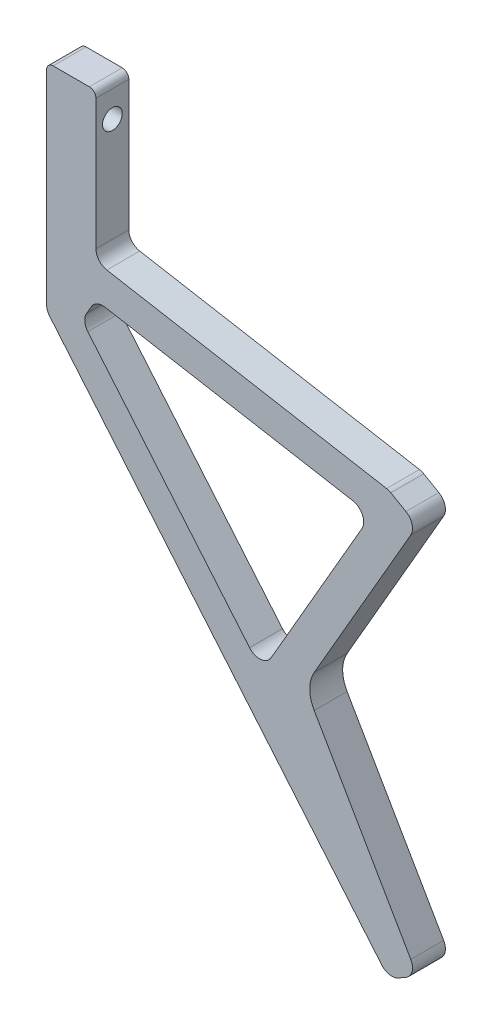
ISO-10303-21;
HEADER;
FILE_DESCRIPTION(('STEP AP214'),'2;1');
FILE_NAME('part.step','',(''),(''),'','','');
FILE_SCHEMA(('AUTOMOTIVE_DESIGN { 1 0 10303 214 1 1 1 1 }'));
ENDSEC;
DATA;
#1=APPLICATION_CONTEXT('core data for automotive mechanical design processes');
#2=APPLICATION_PROTOCOL_DEFINITION('international standard','automotive_design',2000,#1);
#3=PRODUCT_CONTEXT('',#1,'mechanical');
#4=PRODUCT('Part','Part','',(#3));
#5=PRODUCT_RELATED_PRODUCT_CATEGORY('part','',(#4));
#6=PRODUCT_DEFINITION_FORMATION('','',#4);
#7=PRODUCT_DEFINITION_CONTEXT('part definition',#1,'design');
#8=PRODUCT_DEFINITION('design','',#6,#7);
#9=PRODUCT_DEFINITION_SHAPE('','',#8);
#10=(LENGTH_UNIT() NAMED_UNIT(*) SI_UNIT(.MILLI.,.METRE.));
#11=(NAMED_UNIT(*) PLANE_ANGLE_UNIT() SI_UNIT($,.RADIAN.));
#12=(NAMED_UNIT(*) SI_UNIT($,.STERADIAN.) SOLID_ANGLE_UNIT());
#13=UNCERTAINTY_MEASURE_WITH_UNIT(LENGTH_MEASURE(1.E-05),#10,'distance_accuracy_value','');
#14=(GEOMETRIC_REPRESENTATION_CONTEXT(3) GLOBAL_UNCERTAINTY_ASSIGNED_CONTEXT((#13)) GLOBAL_UNIT_ASSIGNED_CONTEXT((#10,
#11,#12)) REPRESENTATION_CONTEXT('',''));
#15=CARTESIAN_POINT('',(0.,0.,0.));
#16=DIRECTION('',(0.,0.,1.));
#17=DIRECTION('',(1.,0.,0.));
#18=AXIS2_PLACEMENT_3D('',#15,#16,#17);
#19=CARTESIAN_POINT('',(-57.15,79.375,3.175));
#20=DIRECTION('',(1.,0.,0.));
#21=DIRECTION('',(0.,1.,0.));
#22=AXIS2_PLACEMENT_3D('',#19,#20,#21);
#23=PLANE('',#22);
#24=CARTESIAN_POINT('',(-57.15,73.025,0.));
#25=DIRECTION('',(1.,0.,0.));
#26=DIRECTION('',(0.,1.,0.));
#27=AXIS2_PLACEMENT_3D('',#24,#25,#26);
#28=CIRCLE('',#27,1.90500000000001);
#29=CARTESIAN_POINT('',(-57.15,74.93,0.));
#30=VERTEX_POINT('',#29);
#31=EDGE_CURVE('E269',#30,#30,#28,.F.);
#32=ORIENTED_EDGE('',*,*,#31,.F.);
#33=EDGE_LOOP('',(#32));
#34=FACE_BOUND('',#33,.T.);
#35=DIRECTION('',(0.,-1.,0.));
#36=VECTOR('',#35,1.);
#37=CARTESIAN_POINT('',(-57.15,79.375,3.175));
#38=LINE('',#37,#36);
#39=CARTESIAN_POINT('',(-57.15,78.105,3.175));
#40=VERTEX_POINT('',#39);
#41=CARTESIAN_POINT('',(-57.15,38.8194990204618,3.175));
#42=VERTEX_POINT('',#41);
#43=EDGE_CURVE('E301',#40,#42,#38,.T.);
#44=ORIENTED_EDGE('',*,*,#43,.F.);
#45=DIRECTION('',(0.,0.,-1.));
#46=VECTOR('',#45,1.);
#47=CARTESIAN_POINT('',(-57.15,78.105,3.175));
#48=LINE('',#47,#46);
#49=CARTESIAN_POINT('',(-57.15,78.105,-3.175));
#50=VERTEX_POINT('',#49);
#51=EDGE_CURVE('E11',#40,#50,#48,.T.);
#52=ORIENTED_EDGE('',*,*,#51,.T.);
#53=DIRECTION('',(0.,-1.,0.));
#54=VECTOR('',#53,1.);
#55=CARTESIAN_POINT('',(-57.15,79.375,-3.175));
#56=LINE('',#55,#54);
#57=CARTESIAN_POINT('',(-57.15,38.8194990204618,-3.175));
#58=VERTEX_POINT('',#57);
#59=EDGE_CURVE('E265',#50,#58,#56,.T.);
#60=ORIENTED_EDGE('',*,*,#59,.T.);
#61=DIRECTION('',(0.,0.,-1.));
#62=VECTOR('',#61,1.);
#63=CARTESIAN_POINT('',(-57.15,38.8194990204618,3.175));
#64=LINE('',#63,#62);
#65=EDGE_CURVE('E371',#58,#42,#64,.F.);
#66=ORIENTED_EDGE('',*,*,#65,.T.);
#67=EDGE_LOOP('',(#44,#52,#60,#66));
#68=FACE_BOUND('',#67,.T.);
#69=ADVANCED_FACE('F39',(#34,#68),#23,.F.);
#70=CARTESIAN_POINT('',(-57.15,37.8950146254257,3.175));
#71=DIRECTION('',(0.766044443118983,0.642787609686533,0.));
#72=DIRECTION('',(-0.642787609686533,0.766044443118984,0.));
#73=AXIS2_PLACEMENT_3D('',#70,#71,#72);
#74=PLANE('',#73);
#75=DIRECTION('',(0.642787609686533,-0.766044443118983,0.));
#76=VECTOR('',#75,1.);
#77=CARTESIAN_POINT('',(-57.15,37.8950146254257,-3.175));
#78=LINE('',#77,#76);
#79=CARTESIAN_POINT('',(-56.5557528855222,37.186818491858,-3.175));
#80=VERTEX_POINT('',#79);
#81=CARTESIAN_POINT('',(7.539379844117,-39.1987862064935,-3.175));
#82=VERTEX_POINT('',#81);
#83=EDGE_CURVE('E268',#80,#82,#78,.T.);
#84=ORIENTED_EDGE('',*,*,#83,.T.);
#85=DIRECTION('',(0.,0.,-1.));
#86=VECTOR('',#85,1.);
#87=CARTESIAN_POINT('',(7.53937984411698,-39.1987862064935,3.175));
#88=LINE('',#87,#86);
#89=CARTESIAN_POINT('',(7.539379844117,-39.1987862064935,3.175));
#90=VERTEX_POINT('',#89);
#91=EDGE_CURVE('E368',#82,#90,#88,.F.);
#92=ORIENTED_EDGE('',*,*,#91,.T.);
#93=DIRECTION('',(0.642787609686533,-0.766044443118983,0.));
#94=VECTOR('',#93,1.);
#95=CARTESIAN_POINT('',(-57.15,37.8950146254257,3.175));
#96=LINE('',#95,#94);
#97=CARTESIAN_POINT('',(-56.5557528855222,37.186818491858,3.175));
#98=VERTEX_POINT('',#97);
#99=EDGE_CURVE('E560',#98,#90,#96,.T.);
#100=ORIENTED_EDGE('',*,*,#99,.F.);
#101=DIRECTION('',(0.,0.,-1.));
#102=VECTOR('',#101,1.);
#103=CARTESIAN_POINT('',(-56.5557528855222,37.186818491858,3.175));
#104=LINE('',#103,#102);
#105=EDGE_CURVE('E364',#98,#80,#104,.T.);
#106=ORIENTED_EDGE('',*,*,#105,.T.);
#107=EDGE_LOOP('',(#84,#92,#100,#106));
#108=FACE_BOUND('',#107,.T.);
#109=ADVANCED_FACE('F498',(#108),#74,.F.);
#110=CARTESIAN_POINT('',(8.90936147349876,-40.8314667350973,3.175));
#111=DIRECTION('',(-0.499999999999991,0.866025403784444,0.));
#112=DIRECTION('',(-0.866025403784444,-0.499999999999991,0.));
#113=AXIS2_PLACEMENT_3D('',#110,#111,#112);
#114=PLANE('',#113);
#115=DIRECTION('',(0.866025403784444,0.499999999999991,0.));
#116=VECTOR('',#115,1.);
#117=CARTESIAN_POINT('',(8.90936147349876,-40.8314667350973,-3.175));
#118=LINE('',#117,#116);
#119=CARTESIAN_POINT('',(10.7551327296392,-39.7658102035022,-3.175));
#120=VERTEX_POINT('',#119);
#121=CARTESIAN_POINT('',(12.2089182619175,-38.9264667350973,-3.175));
#122=VERTEX_POINT('',#121);
#123=EDGE_CURVE('E273',#120,#122,#118,.T.);
#124=ORIENTED_EDGE('',*,*,#123,.T.);
#125=DIRECTION('',(0.,0.,-1.));
#126=VECTOR('',#125,1.);
#127=CARTESIAN_POINT('',(12.2089182619175,-38.9264667350973,3.175));
#128=LINE('',#127,#126);
#129=CARTESIAN_POINT('',(12.2089182619175,-38.9264667350973,3.175));
#130=VERTEX_POINT('',#129);
#131=EDGE_CURVE('E361',#122,#130,#128,.F.);
#132=ORIENTED_EDGE('',*,*,#131,.T.);
#133=DIRECTION('',(0.866025403784444,0.499999999999991,0.));
#134=VECTOR('',#133,1.);
#135=CARTESIAN_POINT('',(8.90936147349876,-40.8314667350973,3.175));
#136=LINE('',#135,#134);
#137=CARTESIAN_POINT('',(10.7551327296392,-39.7658102035022,3.175));
#138=VERTEX_POINT('',#137);
#139=EDGE_CURVE('E228',#138,#130,#136,.T.);
#140=ORIENTED_EDGE('',*,*,#139,.F.);
#141=DIRECTION('',(0.,0.,-1.));
#142=VECTOR('',#141,1.);
#143=CARTESIAN_POINT('',(10.7551327296392,-39.7658102035022,3.175));
#144=LINE('',#143,#142);
#145=EDGE_CURVE('E357',#138,#120,#144,.T.);
#146=ORIENTED_EDGE('',*,*,#145,.T.);
#147=EDGE_LOOP('',(#124,#132,#140,#146));
#148=FACE_BOUND('',#147,.T.);
#149=ADVANCED_FACE('F504',(#148),#114,.F.);
#150=CARTESIAN_POINT('',(-5.49926131403122,-3.17499999999995,3.175));
#151=DIRECTION('',(-0.866025403784443,-0.499999999999992,0.));
#152=DIRECTION('',(0.499999999999992,-0.866025403784443,0.));
#153=AXIS2_PLACEMENT_3D('',#150,#151,#152);
#154=PLANE('',#153);
#155=DIRECTION('',(-0.499999999999992,0.866025403784443,0.));
#156=VECTOR('',#155,1.);
#157=CARTESIAN_POINT('',(-5.49926131403122,-3.17499999999995,3.175));
#158=LINE('',#157,#156);
#159=CARTESIAN_POINT('',(13.13862278753,-35.4567622094849,3.175));
#160=VERTEX_POINT('',#159);
#161=CARTESIAN_POINT('',(-5.49926131403122,-3.17499999999995,3.175));
#162=VERTEX_POINT('',#161);
#163=EDGE_CURVE('E214',#160,#162,#158,.T.);
#164=ORIENTED_EDGE('',*,*,#163,.F.);
#165=DIRECTION('',(0.,0.,-1.));
#166=VECTOR('',#165,1.);
#167=CARTESIAN_POINT('',(13.13862278753,-35.4567622094849,3.175));
#168=LINE('',#167,#166);
#169=CARTESIAN_POINT('',(13.13862278753,-35.4567622094849,-3.175));
#170=VERTEX_POINT('',#169);
#171=EDGE_CURVE('E354',#160,#170,#168,.T.);
#172=ORIENTED_EDGE('',*,*,#171,.T.);
#173=DIRECTION('',(-0.499999999999992,0.866025403784443,0.));
#174=VECTOR('',#173,1.);
#175=CARTESIAN_POINT('',(-5.49926131403122,-3.17499999999995,-3.175));
#176=LINE('',#175,#174);
#177=CARTESIAN_POINT('',(-5.49926131403122,-3.17499999999995,-3.175));
#178=VERTEX_POINT('',#177);
#179=EDGE_CURVE('E234',#170,#178,#176,.T.);
#180=ORIENTED_EDGE('',*,*,#179,.T.);
#181=DIRECTION('',(0.,0.,-1.));
#182=VECTOR('',#181,1.);
#183=CARTESIAN_POINT('',(-5.49926131403122,-3.17499999999995,3.175));
#184=LINE('',#183,#182);
#185=EDGE_CURVE('E231',#162,#178,#184,.T.);
#186=ORIENTED_EDGE('',*,*,#185,.F.);
#187=EDGE_LOOP('',(#164,#172,#180,#186));
#188=FACE_BOUND('',#187,.T.);
#189=ADVANCED_FACE('F232',(#188),#154,.F.);
#190=CARTESIAN_POINT('',(0.,0.,3.175));
#191=DIRECTION('',(0.,0.,-1.));
#192=DIRECTION('',(-1.,0.,0.));
#193=AXIS2_PLACEMENT_3D('',#190,#191,#192);
#194=CYLINDRICAL_SURFACE('',#193,6.35);
#195=CARTESIAN_POINT('',(0.,0.,-3.175));
#196=DIRECTION('',(0.,0.,-1.));
#197=DIRECTION('',(1.,0.,0.));
#198=AXIS2_PLACEMENT_3D('',#195,#196,#197);
#199=CIRCLE('',#198,6.35);
#200=CARTESIAN_POINT('',(-5.49926131403117,3.17500000000002,-3.175));
#201=VERTEX_POINT('',#200);
#202=EDGE_CURVE('E279',#178,#201,#199,.T.);
#203=ORIENTED_EDGE('',*,*,#202,.T.);
#204=DIRECTION('',(0.,0.,-1.));
#205=VECTOR('',#204,1.);
#206=CARTESIAN_POINT('',(-5.49926131403117,3.17500000000002,3.175));
#207=LINE('',#206,#205);
#208=CARTESIAN_POINT('',(-5.49926131403117,3.17500000000002,3.175));
#209=VERTEX_POINT('',#208);
#210=EDGE_CURVE('E239',#209,#201,#207,.T.);
#211=ORIENTED_EDGE('',*,*,#210,.F.);
#212=CARTESIAN_POINT('',(0.,0.,3.175));
#213=DIRECTION('',(0.,0.,-1.));
#214=DIRECTION('',(1.,0.,0.));
#215=AXIS2_PLACEMENT_3D('',#212,#213,#214);
#216=CIRCLE('',#215,6.35);
#217=EDGE_CURVE('E219',#162,#209,#216,.T.);
#218=ORIENTED_EDGE('',*,*,#217,.F.);
#219=ORIENTED_EDGE('',*,*,#185,.T.);
#220=EDGE_LOOP('',(#203,#211,#218,#219));
#221=FACE_BOUND('',#220,.T.);
#222=ADVANCED_FACE('F241',(#221),#194,.F.);
#223=CARTESIAN_POINT('',(-5.49926131403117,3.17500000000002,3.175));
#224=DIRECTION('',(-0.866025403784434,0.500000000000007,0.));
#225=DIRECTION('',(-0.500000000000007,-0.866025403784435,0.));
#226=AXIS2_PLACEMENT_3D('',#223,#224,#225);
#227=PLANE('',#226);
#228=DIRECTION('',(0.500000000000007,0.866025403784435,0.));
#229=VECTOR('',#228,1.);
#230=CARTESIAN_POINT('',(-5.49926131403117,3.17500000000002,-3.175));
#231=LINE('',#230,#229);
#232=CARTESIAN_POINT('',(13.1386227875306,35.4567622094846,-3.175));
#233=VERTEX_POINT('',#232);
#234=EDGE_CURVE('E282',#201,#233,#231,.T.);
#235=ORIENTED_EDGE('',*,*,#234,.T.);
#236=DIRECTION('',(0.,0.,-1.));
#237=VECTOR('',#236,1.);
#238=CARTESIAN_POINT('',(13.1386227875306,35.4567622094846,3.175));
#239=LINE('',#238,#237);
#240=CARTESIAN_POINT('',(13.1386227875306,35.4567622094846,3.175));
#241=VERTEX_POINT('',#240);
#242=EDGE_CURVE('E337',#233,#241,#239,.F.);
#243=ORIENTED_EDGE('',*,*,#242,.T.);
#244=DIRECTION('',(0.500000000000007,0.866025403784435,0.));
#245=VECTOR('',#244,1.);
#246=CARTESIAN_POINT('',(-5.49926131403117,3.17500000000002,3.175));
#247=LINE('',#246,#245);
#248=EDGE_CURVE('E245',#209,#241,#247,.T.);
#249=ORIENTED_EDGE('',*,*,#248,.F.);
#250=ORIENTED_EDGE('',*,*,#210,.T.);
#251=EDGE_LOOP('',(#235,#243,#249,#250));
#252=FACE_BOUND('',#251,.T.);
#253=ADVANCED_FACE('F488',(#252),#227,.F.);
#254=CARTESIAN_POINT('',(8.90936147349946,40.8314667350971,3.175));
#255=DIRECTION('',(-0.500000000000004,-0.866025403784436,0.));
#256=DIRECTION('',(0.866025403784436,-0.500000000000004,0.));
#257=AXIS2_PLACEMENT_3D('',#254,#255,#256);
#258=PLANE('',#257);
#259=DIRECTION('',(-0.866025403784436,0.500000000000004,0.));
#260=VECTOR('',#259,1.);
#261=CARTESIAN_POINT('',(8.90936147349946,40.8314667350971,3.175));
#262=LINE('',#261,#260);
#263=CARTESIAN_POINT('',(12.2089182619181,38.9264667350971,3.175));
#264=VERTEX_POINT('',#263);
#265=CARTESIAN_POINT('',(9.29722873095147,40.6075314695973,3.175));
#266=VERTEX_POINT('',#265);
#267=EDGE_CURVE('E248',#264,#266,#262,.T.);
#268=ORIENTED_EDGE('',*,*,#267,.F.);
#269=DIRECTION('',(0.,0.,-1.));
#270=VECTOR('',#269,1.);
#271=CARTESIAN_POINT('',(12.2089182619181,38.9264667350971,3.175));
#272=LINE('',#271,#270);
#273=CARTESIAN_POINT('',(12.2089182619181,38.9264667350971,-3.175));
#274=VERTEX_POINT('',#273);
#275=EDGE_CURVE('E317',#264,#274,#272,.T.);
#276=ORIENTED_EDGE('',*,*,#275,.T.);
#277=DIRECTION('',(-0.866025403784436,0.500000000000004,0.));
#278=VECTOR('',#277,1.);
#279=CARTESIAN_POINT('',(8.90936147349946,40.8314667350971,-3.175));
#280=LINE('',#279,#278);
#281=CARTESIAN_POINT('',(9.29722873095147,40.6075314695973,-3.175));
#282=VERTEX_POINT('',#281);
#283=EDGE_CURVE('E286',#274,#282,#280,.T.);
#284=ORIENTED_EDGE('',*,*,#283,.T.);
#285=DIRECTION('',(0.,0.,-1.));
#286=VECTOR('',#285,1.);
#287=CARTESIAN_POINT('',(9.29722873095147,40.6075314695973,3.175));
#288=LINE('',#287,#286);
#289=EDGE_CURVE('E314',#282,#266,#288,.F.);
#290=ORIENTED_EDGE('',*,*,#289,.T.);
#291=EDGE_LOOP('',(#268,#276,#284,#290));
#292=FACE_BOUND('',#291,.T.);
#293=ADVANCED_FACE('F480',(#292),#258,.F.);
#294=CARTESIAN_POINT('',(-47.625,50.8,3.175));
#295=DIRECTION('',(-0.173648177666926,-0.984807753012209,0.));
#296=DIRECTION('',(0.984807753012209,-0.173648177666926,0.));
#297=AXIS2_PLACEMENT_3D('',#294,#295,#296);
#298=PLANE('',#297);
#299=DIRECTION('',(-0.984807753012209,0.173648177666926,0.));
#300=VECTOR('',#299,1.);
#301=CARTESIAN_POINT('',(-47.625,50.8,-3.175));
#302=LINE('',#301,#300);
#303=CARTESIAN_POINT('',(8.46829510222544,40.9092386366359,-3.175));
#304=VERTEX_POINT('',#303);
#305=CARTESIAN_POINT('',(-45.526066371274,50.4299013705393,-3.175));
#306=VERTEX_POINT('',#305);
#307=EDGE_CURVE('E290',#304,#306,#302,.T.);
#308=ORIENTED_EDGE('',*,*,#307,.T.);
#309=DIRECTION('',(0.,0.,-1.));
#310=VECTOR('',#309,1.);
#311=CARTESIAN_POINT('',(-45.526066371274,50.4299013705393,3.175));
#312=LINE('',#311,#310);
#313=CARTESIAN_POINT('',(-45.526066371274,50.4299013705393,3.175));
#314=VERTEX_POINT('',#313);
#315=EDGE_CURVE('E311',#306,#314,#312,.F.);
#316=ORIENTED_EDGE('',*,*,#315,.T.);
#317=DIRECTION('',(-0.984807753012209,0.173648177666926,0.));
#318=VECTOR('',#317,1.);
#319=CARTESIAN_POINT('',(-47.625,50.8,3.175));
#320=LINE('',#319,#318);
#321=CARTESIAN_POINT('',(8.46829510222544,40.9092386366359,3.175));
#322=VERTEX_POINT('',#321);
#323=EDGE_CURVE('E255',#322,#314,#320,.T.);
#324=ORIENTED_EDGE('',*,*,#323,.F.);
#325=DIRECTION('',(0.,0.,-1.));
#326=VECTOR('',#325,1.);
#327=CARTESIAN_POINT('',(8.46829510222546,40.9092386366359,3.175));
#328=LINE('',#327,#326);
#329=EDGE_CURVE('E307',#322,#304,#328,.T.);
#330=ORIENTED_EDGE('',*,*,#329,.T.);
#331=EDGE_LOOP('',(#308,#316,#324,#330));
#332=FACE_BOUND('',#331,.T.);
#333=ADVANCED_FACE('F470',(#332),#298,.F.);
#334=CARTESIAN_POINT('',(-47.625,79.375,3.175));
#335=DIRECTION('',(-1.,0.,0.));
#336=DIRECTION('',(0.,-1.,0.));
#337=AXIS2_PLACEMENT_3D('',#334,#335,#336);
#338=PLANE('',#337);
#339=CARTESIAN_POINT('',(-47.625,73.025,0.));
#340=DIRECTION('',(1.,0.,0.));
#341=DIRECTION('',(0.,1.,0.));
#342=AXIS2_PLACEMENT_3D('',#339,#340,#341);
#343=CIRCLE('',#342,1.90500000000001);
#344=CARTESIAN_POINT('',(-47.625,74.93,0.));
#345=VERTEX_POINT('',#344);
#346=EDGE_CURVE('E572',#345,#345,#343,.T.);
#347=ORIENTED_EDGE('',*,*,#346,.F.);
#348=EDGE_LOOP('',(#347));
#349=FACE_BOUND('',#348,.T.);
#350=DIRECTION('',(0.,1.,0.));
#351=VECTOR('',#350,1.);
#352=CARTESIAN_POINT('',(-47.625,79.375,-3.175));
#353=LINE('',#352,#351);
#354=CARTESIAN_POINT('',(-47.625,52.9313130631903,-3.175));
#355=VERTEX_POINT('',#354);
#356=CARTESIAN_POINT('',(-47.625,78.105,-3.175));
#357=VERTEX_POINT('',#356);
#358=EDGE_CURVE('E294',#355,#357,#353,.T.);
#359=ORIENTED_EDGE('',*,*,#358,.T.);
#360=DIRECTION('',(0.,0.,-1.));
#361=VECTOR('',#360,1.);
#362=CARTESIAN_POINT('',(-47.625,78.105,3.175));
#363=LINE('',#362,#361);
#364=CARTESIAN_POINT('',(-47.625,78.105,3.175));
#365=VERTEX_POINT('',#364);
#366=EDGE_CURVE('E63',#357,#365,#363,.F.);
#367=ORIENTED_EDGE('',*,*,#366,.T.);
#368=DIRECTION('',(0.,1.,0.));
#369=VECTOR('',#368,1.);
#370=CARTESIAN_POINT('',(-47.625,79.375,3.175));
#371=LINE('',#370,#369);
#372=CARTESIAN_POINT('',(-47.625,52.9313130631903,3.175));
#373=VERTEX_POINT('',#372);
#374=EDGE_CURVE('E259',#373,#365,#371,.T.);
#375=ORIENTED_EDGE('',*,*,#374,.F.);
#376=DIRECTION('',(0.,0.,-1.));
#377=VECTOR('',#376,1.);
#378=CARTESIAN_POINT('',(-47.625,52.9313130631903,-3.175));
#379=LINE('',#378,#377);
#380=EDGE_CURVE('E238',#373,#355,#379,.T.);
#381=ORIENTED_EDGE('',*,*,#380,.T.);
#382=EDGE_LOOP('',(#359,#367,#375,#381));
#383=FACE_BOUND('',#382,.T.);
#384=ADVANCED_FACE('F462',(#349,#383),#338,.F.);
#385=CARTESIAN_POINT('',(-57.15,79.375,3.175));
#386=DIRECTION('',(0.,-1.,0.));
#387=DIRECTION('',(0.,0.,-1.));
#388=AXIS2_PLACEMENT_3D('',#385,#386,#387);
#389=PLANE('',#388);
#390=DIRECTION('',(-1.,0.,0.));
#391=VECTOR('',#390,1.);
#392=CARTESIAN_POINT('',(-57.15,79.375,3.175));
#393=LINE('',#392,#391);
#394=CARTESIAN_POINT('',(-48.895,79.375,3.175));
#395=VERTEX_POINT('',#394);
#396=CARTESIAN_POINT('',(-55.88,79.375,3.175));
#397=VERTEX_POINT('',#396);
#398=EDGE_CURVE('E262',#395,#397,#393,.T.);
#399=ORIENTED_EDGE('',*,*,#398,.F.);
#400=DIRECTION('',(0.,0.,-1.));
#401=VECTOR('',#400,1.);
#402=CARTESIAN_POINT('',(-48.895,79.375,3.175));
#403=LINE('',#402,#401);
#404=CARTESIAN_POINT('',(-48.895,79.375,-3.175));
#405=VERTEX_POINT('',#404);
#406=EDGE_CURVE('E436',#395,#405,#403,.T.);
#407=ORIENTED_EDGE('',*,*,#406,.T.);
#408=DIRECTION('',(-1.,0.,0.));
#409=VECTOR('',#408,1.);
#410=CARTESIAN_POINT('',(-57.15,79.375,-3.175));
#411=LINE('',#410,#409);
#412=CARTESIAN_POINT('',(-55.88,79.375,-3.175));
#413=VERTEX_POINT('',#412);
#414=EDGE_CURVE('E297',#405,#413,#411,.T.);
#415=ORIENTED_EDGE('',*,*,#414,.T.);
#416=DIRECTION('',(0.,0.,-1.));
#417=VECTOR('',#416,1.);
#418=CARTESIAN_POINT('',(-55.88,79.375,3.175));
#419=LINE('',#418,#417);
#420=EDGE_CURVE('E433',#413,#397,#419,.F.);
#421=ORIENTED_EDGE('',*,*,#420,.T.);
#422=EDGE_LOOP('',(#399,#407,#415,#421));
#423=FACE_BOUND('',#422,.T.);
#424=ADVANCED_FACE('F455',(#423),#389,.F.);
#425=CARTESIAN_POINT('',(0.,0.,3.175));
#426=DIRECTION('',(0.,0.,1.));
#427=DIRECTION('',(1.,0.,0.));
#428=AXIS2_PLACEMENT_3D('',#425,#426,#427);
#429=PLANE('',#428);
#430=DIRECTION('',(-0.984807753012209,0.173648177666926,0.));
#431=VECTOR('',#430,1.);
#432=CARTESIAN_POINT('',(5.53059704588809,34.9792750796685,3.175));
#433=LINE('',#432,#431);
#434=CARTESIAN_POINT('',(1.95821092298711,35.6091831386444,3.175));
#435=VERTEX_POINT('',#434);
#436=CARTESIAN_POINT('',(-45.8734926766398,44.0432030165087,3.175));
#437=VERTEX_POINT('',#436);
#438=EDGE_CURVE('E594',#435,#437,#433,.T.);
#439=ORIENTED_EDGE('',*,*,#438,.F.);
#440=CARTESIAN_POINT('',(1.51714455171312,33.1077714459934,3.175));
#441=DIRECTION('',(0.,0.,1.));
#442=DIRECTION('',(1.,0.,0.));
#443=AXIS2_PLACEMENT_3D('',#440,#441,#442);
#444=CIRCLE('',#443,2.54);
#445=CARTESIAN_POINT('',(3.7168490773256,31.8377714459934,3.175));
#446=VERTEX_POINT('',#445);
#447=EDGE_CURVE('E409',#435,#446,#444,.F.);
#448=ORIENTED_EDGE('',*,*,#447,.T.);
#449=DIRECTION('',(0.5,0.866025403784439,0.));
#450=VECTOR('',#449,1.);
#451=CARTESIAN_POINT('',(-15.6422423087603,-1.6931584230763,3.175));
#452=LINE('',#451,#450);
#453=CARTESIAN_POINT('',(-13.8284943401978,1.4483452105988,3.175));
#454=VERTEX_POINT('',#453);
#455=EDGE_CURVE('E581',#454,#446,#452,.T.);
#456=ORIENTED_EDGE('',*,*,#455,.F.);
#457=CARTESIAN_POINT('',(-16.0281988658102,2.7183452105988,3.175));
#458=DIRECTION('',(0.,0.,1.));
#459=DIRECTION('',(1.,0.,0.));
#460=AXIS2_PLACEMENT_3D('',#457,#458,#459);
#461=CIRCLE('',#460,2.54);
#462=CARTESIAN_POINT('',(-17.9739517513325,1.085664681995,3.175));
#463=VERTEX_POINT('',#462);
#464=EDGE_CURVE('E415',#454,#463,#461,.F.);
#465=ORIENTED_EDGE('',*,*,#464,.T.);
#466=DIRECTION('',(0.642787609686533,-0.766044443118983,0.));
#467=VECTOR('',#466,1.);
#468=CARTESIAN_POINT('',(-50.3370942350158,39.6545560045635,3.175));
#469=LINE('',#468,#467);
#470=CARTESIAN_POINT('',(-49.1938790213992,38.2921251666276,3.175));
#471=VERTEX_POINT('',#470);
#472=EDGE_CURVE('E586',#471,#463,#469,.T.);
#473=ORIENTED_EDGE('',*,*,#472,.F.);
#474=CARTESIAN_POINT('',(-47.248126135877,39.9248056952314,3.175));
#475=DIRECTION('',(0.,0.,1.));
#476=DIRECTION('',(1.,0.,0.));
#477=AXIS2_PLACEMENT_3D('',#474,#475,#476);
#478=CIRCLE('',#477,2.54);
#479=CARTESIAN_POINT('',(-49.4478306614895,41.1948056952314,3.175));
#480=VERTEX_POINT('',#479);
#481=EDGE_CURVE('E421',#471,#480,#478,.F.);
#482=ORIENTED_EDGE('',*,*,#481,.T.);
#483=DIRECTION('',(-0.5,-0.866025403784438,0.));
#484=VECTOR('',#483,1.);
#485=CARTESIAN_POINT('',(-47.625,44.3520410145255,3.175));
#486=LINE('',#485,#484);
#487=CARTESIAN_POINT('',(-48.5142635735263,42.8117913238577,3.175));
#488=VERTEX_POINT('',#487);
#489=EDGE_CURVE('E590',#488,#480,#486,.T.);
#490=ORIENTED_EDGE('',*,*,#489,.F.);
#491=CARTESIAN_POINT('',(-46.3145590479138,41.5417913238577,3.175));
#492=DIRECTION('',(0.,0.,1.));
#493=DIRECTION('',(1.,0.,0.));
#494=AXIS2_PLACEMENT_3D('',#491,#492,#493);
#495=CIRCLE('',#494,2.54);
#496=EDGE_CURVE('E427',#488,#437,#495,.F.);
#497=ORIENTED_EDGE('',*,*,#496,.T.);
#498=EDGE_LOOP('',(#439,#448,#456,#465,#473,#482,#490,#497));
#499=FACE_BOUND('',#498,.T.);
#500=ORIENTED_EDGE('',*,*,#374,.T.);
#501=CARTESIAN_POINT('',(-48.895,78.105,3.175));
#502=DIRECTION('',(0.,0.,1.));
#503=DIRECTION('',(1.,0.,0.));
#504=AXIS2_PLACEMENT_3D('',#501,#502,#503);
#505=CIRCLE('',#504,1.27);
#506=EDGE_CURVE('E48',#365,#395,#505,.T.);
#507=ORIENTED_EDGE('',*,*,#506,.T.);
#508=ORIENTED_EDGE('',*,*,#398,.T.);
#509=CARTESIAN_POINT('',(-55.88,78.105,3.175));
#510=DIRECTION('',(0.,0.,1.));
#511=DIRECTION('',(1.,0.,0.));
#512=AXIS2_PLACEMENT_3D('',#509,#510,#511);
#513=CIRCLE('',#512,1.27);
#514=EDGE_CURVE('E55',#397,#40,#513,.T.);
#515=ORIENTED_EDGE('',*,*,#514,.T.);
#516=ORIENTED_EDGE('',*,*,#43,.T.);
#517=CARTESIAN_POINT('',(-54.61,38.8194990204618,3.175));
#518=DIRECTION('',(0.,0.,1.));
#519=DIRECTION('',(1.,0.,0.));
#520=AXIS2_PLACEMENT_3D('',#517,#518,#519);
#521=CIRCLE('',#520,2.54);
#522=EDGE_CURVE('E340',#42,#98,#521,.T.);
#523=ORIENTED_EDGE('',*,*,#522,.T.);
#524=ORIENTED_EDGE('',*,*,#99,.T.);
#525=CARTESIAN_POINT('',(9.48513272963921,-37.5661056778897,3.175));
#526=DIRECTION('',(0.,0.,1.));
#527=DIRECTION('',(1.,0.,0.));
#528=AXIS2_PLACEMENT_3D('',#525,#526,#527);
#529=CIRCLE('',#528,2.54);
#530=EDGE_CURVE('E343',#90,#138,#529,.T.);
#531=ORIENTED_EDGE('',*,*,#530,.T.);
#532=ORIENTED_EDGE('',*,*,#139,.T.);
#533=CARTESIAN_POINT('',(10.9389182619175,-36.7267622094849,3.175));
#534=DIRECTION('',(0.,0.,1.));
#535=DIRECTION('',(1.,0.,0.));
#536=AXIS2_PLACEMENT_3D('',#533,#534,#535);
#537=CIRCLE('',#536,2.54);
#538=EDGE_CURVE('E223',#130,#160,#537,.T.);
#539=ORIENTED_EDGE('',*,*,#538,.T.);
#540=ORIENTED_EDGE('',*,*,#163,.T.);
#541=ORIENTED_EDGE('',*,*,#217,.T.);
#542=ORIENTED_EDGE('',*,*,#248,.T.);
#543=CARTESIAN_POINT('',(10.9389182619181,36.7267622094846,3.175));
#544=DIRECTION('',(0.,0.,1.));
#545=DIRECTION('',(1.,0.,0.));
#546=AXIS2_PLACEMENT_3D('',#543,#544,#545);
#547=CIRCLE('',#546,2.54);
#548=EDGE_CURVE('E351',#241,#264,#547,.T.);
#549=ORIENTED_EDGE('',*,*,#548,.T.);
#550=ORIENTED_EDGE('',*,*,#267,.T.);
#551=CARTESIAN_POINT('',(8.02722873095146,38.4078269439849,3.175));
#552=DIRECTION('',(0.,0.,1.));
#553=DIRECTION('',(1.,0.,0.));
#554=AXIS2_PLACEMENT_3D('',#551,#552,#553);
#555=CIRCLE('',#554,2.54);
#556=EDGE_CURVE('E348',#266,#322,#555,.T.);
#557=ORIENTED_EDGE('',*,*,#556,.T.);
#558=ORIENTED_EDGE('',*,*,#323,.T.);
#559=CARTESIAN_POINT('',(-45.085,52.9313130631903,3.175));
#560=DIRECTION('',(0.,0.,1.));
#561=DIRECTION('',(1.,0.,0.));
#562=AXIS2_PLACEMENT_3D('',#559,#560,#561);
#563=CIRCLE('',#562,2.54);
#564=EDGE_CURVE('E406',#314,#373,#563,.F.);
#565=ORIENTED_EDGE('',*,*,#564,.T.);
#566=EDGE_LOOP('',(#500,#507,#508,#515,#516,#523,#524,#531,#532,#539,#540,#541,#542,#549,#550,
#557,#558,#565));
#567=FACE_BOUND('',#566,.T.);
#568=ADVANCED_FACE('F216',(#499,#567),#429,.T.);
#569=CARTESIAN_POINT('',(0.,0.,-3.175));
#570=DIRECTION('',(0.,0.,1.));
#571=DIRECTION('',(1.,0.,0.));
#572=AXIS2_PLACEMENT_3D('',#569,#570,#571);
#573=PLANE('',#572);
#574=DIRECTION('',(-0.5,-0.866025403784439,0.));
#575=VECTOR('',#574,1.);
#576=CARTESIAN_POINT('',(-15.6422423087603,-1.6931584230763,-3.175));
#577=LINE('',#576,#575);
#578=CARTESIAN_POINT('',(3.7168490773256,31.8377714459934,-3.175));
#579=VERTEX_POINT('',#578);
#580=CARTESIAN_POINT('',(-13.8284943401978,1.4483452105988,-3.175));
#581=VERTEX_POINT('',#580);
#582=EDGE_CURVE('E601',#579,#581,#577,.T.);
#583=ORIENTED_EDGE('',*,*,#582,.F.);
#584=CARTESIAN_POINT('',(1.51714455171312,33.1077714459934,-3.175));
#585=DIRECTION('',(0.,0.,1.));
#586=DIRECTION('',(1.,0.,0.));
#587=AXIS2_PLACEMENT_3D('',#584,#585,#586);
#588=CIRCLE('',#587,2.54);
#589=CARTESIAN_POINT('',(1.95821092298711,35.6091831386444,-3.175));
#590=VERTEX_POINT('',#589);
#591=EDGE_CURVE('E412',#579,#590,#588,.T.);
#592=ORIENTED_EDGE('',*,*,#591,.T.);
#593=DIRECTION('',(0.984807753012209,-0.173648177666926,0.));
#594=VECTOR('',#593,1.);
#595=CARTESIAN_POINT('',(5.53059704588809,34.9792750796685,-3.175));
#596=LINE('',#595,#594);
#597=CARTESIAN_POINT('',(-45.8734926766399,44.0432030165087,-3.175));
#598=VERTEX_POINT('',#597);
#599=EDGE_CURVE('E580',#598,#590,#596,.T.);
#600=ORIENTED_EDGE('',*,*,#599,.F.);
#601=CARTESIAN_POINT('',(-46.3145590479138,41.5417913238577,-3.175));
#602=DIRECTION('',(0.,0.,1.));
#603=DIRECTION('',(1.,0.,0.));
#604=AXIS2_PLACEMENT_3D('',#601,#602,#603);
#605=CIRCLE('',#604,2.54);
#606=CARTESIAN_POINT('',(-48.5142635735263,42.8117913238577,-3.175));
#607=VERTEX_POINT('',#606);
#608=EDGE_CURVE('E430',#598,#607,#605,.T.);
#609=ORIENTED_EDGE('',*,*,#608,.T.);
#610=DIRECTION('',(0.5,0.866025403784438,0.));
#611=VECTOR('',#610,1.);
#612=CARTESIAN_POINT('',(-47.625,44.3520410145255,-3.175));
#613=LINE('',#612,#611);
#614=CARTESIAN_POINT('',(-49.4478306614895,41.1948056952314,-3.175));
#615=VERTEX_POINT('',#614);
#616=EDGE_CURVE('E576',#615,#607,#613,.T.);
#617=ORIENTED_EDGE('',*,*,#616,.F.);
#618=CARTESIAN_POINT('',(-47.248126135877,39.9248056952314,-3.175));
#619=DIRECTION('',(0.,0.,1.));
#620=DIRECTION('',(1.,0.,0.));
#621=AXIS2_PLACEMENT_3D('',#618,#619,#620);
#622=CIRCLE('',#621,2.54);
#623=CARTESIAN_POINT('',(-49.1938790213992,38.2921251666276,-3.175));
#624=VERTEX_POINT('',#623);
#625=EDGE_CURVE('E424',#615,#624,#622,.T.);
#626=ORIENTED_EDGE('',*,*,#625,.T.);
#627=DIRECTION('',(-0.642787609686533,0.766044443118983,0.));
#628=VECTOR('',#627,1.);
#629=CARTESIAN_POINT('',(-50.3370942350158,39.6545560045635,-3.175));
#630=LINE('',#629,#628);
#631=CARTESIAN_POINT('',(-17.9739517513325,1.085664681995,-3.175));
#632=VERTEX_POINT('',#631);
#633=EDGE_CURVE('E585',#632,#624,#630,.T.);
#634=ORIENTED_EDGE('',*,*,#633,.F.);
#635=CARTESIAN_POINT('',(-16.0281988658102,2.7183452105988,-3.175));
#636=DIRECTION('',(0.,0.,1.));
#637=DIRECTION('',(1.,0.,0.));
#638=AXIS2_PLACEMENT_3D('',#635,#636,#637);
#639=CIRCLE('',#638,2.54);
#640=EDGE_CURVE('E418',#632,#581,#639,.T.);
#641=ORIENTED_EDGE('',*,*,#640,.T.);
#642=EDGE_LOOP('',(#583,#592,#600,#609,#617,#626,#634,#641));
#643=FACE_BOUND('',#642,.T.);
#644=ORIENTED_EDGE('',*,*,#414,.F.);
#645=CARTESIAN_POINT('',(-48.895,78.105,-3.175));
#646=DIRECTION('',(0.,0.,1.));
#647=DIRECTION('',(1.,0.,0.));
#648=AXIS2_PLACEMENT_3D('',#645,#646,#647);
#649=CIRCLE('',#648,1.27);
#650=EDGE_CURVE('E443',#405,#357,#649,.F.);
#651=ORIENTED_EDGE('',*,*,#650,.T.);
#652=ORIENTED_EDGE('',*,*,#358,.F.);
#653=CARTESIAN_POINT('',(-45.085,52.9313130631903,-3.175));
#654=DIRECTION('',(0.,0.,1.));
#655=DIRECTION('',(1.,0.,0.));
#656=AXIS2_PLACEMENT_3D('',#653,#654,#655);
#657=CIRCLE('',#656,2.54);
#658=EDGE_CURVE('E403',#355,#306,#657,.T.);
#659=ORIENTED_EDGE('',*,*,#658,.T.);
#660=ORIENTED_EDGE('',*,*,#307,.F.);
#661=CARTESIAN_POINT('',(8.02722873095146,38.4078269439849,-3.175));
#662=DIRECTION('',(0.,0.,1.));
#663=DIRECTION('',(1.,0.,0.));
#664=AXIS2_PLACEMENT_3D('',#661,#662,#663);
#665=CIRCLE('',#664,2.54);
#666=EDGE_CURVE('E331',#304,#282,#665,.F.);
#667=ORIENTED_EDGE('',*,*,#666,.T.);
#668=ORIENTED_EDGE('',*,*,#283,.F.);
#669=CARTESIAN_POINT('',(10.9389182619181,36.7267622094846,-3.175));
#670=DIRECTION('',(0.,0.,1.));
#671=DIRECTION('',(1.,0.,0.));
#672=AXIS2_PLACEMENT_3D('',#669,#670,#671);
#673=CIRCLE('',#672,2.54);
#674=EDGE_CURVE('E334',#274,#233,#673,.F.);
#675=ORIENTED_EDGE('',*,*,#674,.T.);
#676=ORIENTED_EDGE('',*,*,#234,.F.);
#677=ORIENTED_EDGE('',*,*,#202,.F.);
#678=ORIENTED_EDGE('',*,*,#179,.F.);
#679=CARTESIAN_POINT('',(10.9389182619175,-36.7267622094849,-3.175));
#680=DIRECTION('',(0.,0.,1.));
#681=DIRECTION('',(1.,0.,0.));
#682=AXIS2_PLACEMENT_3D('',#679,#680,#681);
#683=CIRCLE('',#682,2.54);
#684=EDGE_CURVE('E328',#170,#122,#683,.F.);
#685=ORIENTED_EDGE('',*,*,#684,.T.);
#686=ORIENTED_EDGE('',*,*,#123,.F.);
#687=CARTESIAN_POINT('',(9.48513272963921,-37.5661056778897,-3.175));
#688=DIRECTION('',(0.,0.,1.));
#689=DIRECTION('',(1.,0.,0.));
#690=AXIS2_PLACEMENT_3D('',#687,#688,#689);
#691=CIRCLE('',#690,2.54);
#692=EDGE_CURVE('E325',#120,#82,#691,.F.);
#693=ORIENTED_EDGE('',*,*,#692,.T.);
#694=ORIENTED_EDGE('',*,*,#83,.F.);
#695=CARTESIAN_POINT('',(-54.61,38.8194990204618,-3.175));
#696=DIRECTION('',(0.,0.,1.));
#697=DIRECTION('',(1.,0.,0.));
#698=AXIS2_PLACEMENT_3D('',#695,#696,#697);
#699=CIRCLE('',#698,2.54);
#700=EDGE_CURVE('E321',#80,#58,#699,.F.);
#701=ORIENTED_EDGE('',*,*,#700,.T.);
#702=ORIENTED_EDGE('',*,*,#59,.F.);
#703=CARTESIAN_POINT('',(-55.88,78.105,-3.175));
#704=DIRECTION('',(0.,0.,1.));
#705=DIRECTION('',(1.,0.,0.));
#706=AXIS2_PLACEMENT_3D('',#703,#704,#705);
#707=CIRCLE('',#706,1.27);
#708=EDGE_CURVE('E440',#50,#413,#707,.F.);
#709=ORIENTED_EDGE('',*,*,#708,.T.);
#710=EDGE_LOOP('',(#644,#651,#652,#659,#660,#667,#668,#675,#676,#677,#678,#685,#686,#693,#694,
#701,#702,#709));
#711=FACE_BOUND('',#710,.T.);
#712=ADVANCED_FACE('F461',(#643,#711),#573,.F.);
#713=CARTESIAN_POINT('',(-62.5381536726415,73.025,0.));
#714=DIRECTION('',(1.,0.,0.));
#715=DIRECTION('',(0.,1.,0.));
#716=AXIS2_PLACEMENT_3D('',#713,#714,#715);
#717=CYLINDRICAL_SURFACE('',#716,1.90500000000001);
#718=ORIENTED_EDGE('',*,*,#31,.T.);
#719=EDGE_LOOP('',(#718));
#720=FACE_BOUND('',#719,.T.);
#721=ORIENTED_EDGE('',*,*,#346,.T.);
#722=EDGE_LOOP('',(#721));
#723=FACE_BOUND('',#722,.T.);
#724=ADVANCED_FACE('F637',(#720,#723),#717,.F.);
#725=CARTESIAN_POINT('',(5.53059704588809,34.9792750796685,-75.572232822166));
#726=DIRECTION('',(0.173648177666926,0.984807753012209,0.));
#727=DIRECTION('',(-0.984807753012209,0.173648177666926,0.));
#728=AXIS2_PLACEMENT_3D('',#725,#726,#727);
#729=PLANE('',#728);
#730=ORIENTED_EDGE('',*,*,#599,.T.);
#731=DIRECTION('',(0.,0.,1.));
#732=VECTOR('',#731,1.);
#733=CARTESIAN_POINT('',(1.95821092298711,35.6091831386444,3.17499999999997));
#734=LINE('',#733,#732);
#735=EDGE_CURVE('E378',#590,#435,#734,.T.);
#736=ORIENTED_EDGE('',*,*,#735,.T.);
#737=ORIENTED_EDGE('',*,*,#438,.T.);
#738=DIRECTION('',(0.,0.,1.));
#739=VECTOR('',#738,1.);
#740=CARTESIAN_POINT('',(-45.8734926766398,44.0432030165087,-3.175));
#741=LINE('',#740,#739);
#742=EDGE_CURVE('E375',#437,#598,#741,.F.);
#743=ORIENTED_EDGE('',*,*,#742,.T.);
#744=EDGE_LOOP('',(#730,#736,#737,#743));
#745=FACE_BOUND('',#744,.T.);
#746=ADVANCED_FACE('F626',(#745),#729,.F.);
#747=CARTESIAN_POINT('',(-15.6422423087603,-1.6931584230763,-75.572232822166));
#748=DIRECTION('',(0.866025403784439,-0.5,0.));
#749=DIRECTION('',(0.5,0.866025403784439,0.));
#750=AXIS2_PLACEMENT_3D('',#747,#748,#749);
#751=PLANE('',#750);
#752=ORIENTED_EDGE('',*,*,#455,.T.);
#753=DIRECTION('',(0.,0.,1.));
#754=VECTOR('',#753,1.);
#755=CARTESIAN_POINT('',(3.71684907732559,31.8377714459934,-3.17500000000003));
#756=LINE('',#755,#754);
#757=EDGE_CURVE('E386',#446,#579,#756,.F.);
#758=ORIENTED_EDGE('',*,*,#757,.T.);
#759=ORIENTED_EDGE('',*,*,#582,.T.);
#760=DIRECTION('',(0.,0.,1.));
#761=VECTOR('',#760,1.);
#762=CARTESIAN_POINT('',(-13.8284943401978,1.4483452105988,3.175));
#763=LINE('',#762,#761);
#764=EDGE_CURVE('E382',#581,#454,#763,.T.);
#765=ORIENTED_EDGE('',*,*,#764,.T.);
#766=EDGE_LOOP('',(#752,#758,#759,#765));
#767=FACE_BOUND('',#766,.T.);
#768=ADVANCED_FACE('F633',(#767),#751,.F.);
#769=CARTESIAN_POINT('',(-50.3370942350158,39.6545560045635,-75.572232822166));
#770=DIRECTION('',(-0.766044443118983,-0.642787609686533,0.));
#771=DIRECTION('',(0.642787609686533,-0.766044443118983,0.));
#772=AXIS2_PLACEMENT_3D('',#769,#770,#771);
#773=PLANE('',#772);
#774=ORIENTED_EDGE('',*,*,#472,.T.);
#775=DIRECTION('',(0.,0.,1.));
#776=VECTOR('',#775,1.);
#777=CARTESIAN_POINT('',(-17.9739517513325,1.085664681995,-3.175));
#778=LINE('',#777,#776);
#779=EDGE_CURVE('E393',#463,#632,#778,.F.);
#780=ORIENTED_EDGE('',*,*,#779,.T.);
#781=ORIENTED_EDGE('',*,*,#633,.T.);
#782=DIRECTION('',(0.,0.,1.));
#783=VECTOR('',#782,1.);
#784=CARTESIAN_POINT('',(-49.1938790213992,38.2921251666276,3.175));
#785=LINE('',#784,#783);
#786=EDGE_CURVE('E389',#624,#471,#785,.T.);
#787=ORIENTED_EDGE('',*,*,#786,.T.);
#788=EDGE_LOOP('',(#774,#780,#781,#787));
#789=FACE_BOUND('',#788,.T.);
#790=ADVANCED_FACE('F610',(#789),#773,.F.);
#791=CARTESIAN_POINT('',(-47.625,44.3520410145255,-75.572232822166));
#792=DIRECTION('',(-0.866025403784438,0.5,0.));
#793=DIRECTION('',(-0.5,-0.866025403784438,0.));
#794=AXIS2_PLACEMENT_3D('',#791,#792,#793);
#795=PLANE('',#794);
#796=ORIENTED_EDGE('',*,*,#489,.T.);
#797=DIRECTION('',(0.,0.,1.));
#798=VECTOR('',#797,1.);
#799=CARTESIAN_POINT('',(-49.4478306614895,41.1948056952314,-3.175));
#800=LINE('',#799,#798);
#801=EDGE_CURVE('E400',#480,#615,#800,.F.);
#802=ORIENTED_EDGE('',*,*,#801,.T.);
#803=ORIENTED_EDGE('',*,*,#616,.T.);
#804=DIRECTION('',(0.,0.,1.));
#805=VECTOR('',#804,1.);
#806=CARTESIAN_POINT('',(-48.5142635735263,42.8117913238577,3.175));
#807=LINE('',#806,#805);
#808=EDGE_CURVE('E396',#607,#488,#807,.T.);
#809=ORIENTED_EDGE('',*,*,#808,.T.);
#810=EDGE_LOOP('',(#796,#802,#803,#809));
#811=FACE_BOUND('',#810,.T.);
#812=ADVANCED_FACE('F513',(#811),#795,.F.);
#813=CARTESIAN_POINT('',(-45.085,52.9313130631903,3.175));
#814=DIRECTION('',(0.,0.,1.));
#815=DIRECTION('',(1.,0.,0.));
#816=AXIS2_PLACEMENT_3D('',#813,#814,#815);
#817=CYLINDRICAL_SURFACE('',#816,2.54);
#818=ORIENTED_EDGE('',*,*,#564,.F.);
#819=ORIENTED_EDGE('',*,*,#315,.F.);
#820=ORIENTED_EDGE('',*,*,#658,.F.);
#821=ORIENTED_EDGE('',*,*,#380,.F.);
#822=EDGE_LOOP('',(#818,#819,#820,#821));
#823=FACE_BOUND('',#822,.T.);
#824=ADVANCED_FACE('F466',(#823),#817,.F.);
#825=CARTESIAN_POINT('',(10.9389182619181,36.7267622094846,3.175));
#826=DIRECTION('',(0.,0.,-1.));
#827=DIRECTION('',(-1.,0.,0.));
#828=AXIS2_PLACEMENT_3D('',#825,#826,#827);
#829=CYLINDRICAL_SURFACE('',#828,2.54);
#830=ORIENTED_EDGE('',*,*,#548,.F.);
#831=ORIENTED_EDGE('',*,*,#242,.F.);
#832=ORIENTED_EDGE('',*,*,#674,.F.);
#833=ORIENTED_EDGE('',*,*,#275,.F.);
#834=EDGE_LOOP('',(#830,#831,#832,#833));
#835=FACE_BOUND('',#834,.T.);
#836=ADVANCED_FACE('F484',(#835),#829,.T.);
#837=CARTESIAN_POINT('',(8.02722873095146,38.4078269439849,3.175));
#838=DIRECTION('',(0.,0.,-1.));
#839=DIRECTION('',(-1.,0.,0.));
#840=AXIS2_PLACEMENT_3D('',#837,#838,#839);
#841=CYLINDRICAL_SURFACE('',#840,2.54);
#842=ORIENTED_EDGE('',*,*,#556,.F.);
#843=ORIENTED_EDGE('',*,*,#289,.F.);
#844=ORIENTED_EDGE('',*,*,#666,.F.);
#845=ORIENTED_EDGE('',*,*,#329,.F.);
#846=EDGE_LOOP('',(#842,#843,#844,#845));
#847=FACE_BOUND('',#846,.T.);
#848=ADVANCED_FACE('F475',(#847),#841,.T.);
#849=CARTESIAN_POINT('',(10.9389182619175,-36.7267622094849,3.175));
#850=DIRECTION('',(0.,0.,-1.));
#851=DIRECTION('',(-1.,0.,0.));
#852=AXIS2_PLACEMENT_3D('',#849,#850,#851);
#853=CYLINDRICAL_SURFACE('',#852,2.54);
#854=ORIENTED_EDGE('',*,*,#538,.F.);
#855=ORIENTED_EDGE('',*,*,#131,.F.);
#856=ORIENTED_EDGE('',*,*,#684,.F.);
#857=ORIENTED_EDGE('',*,*,#171,.F.);
#858=EDGE_LOOP('',(#854,#855,#856,#857));
#859=FACE_BOUND('',#858,.T.);
#860=ADVANCED_FACE('F518',(#859),#853,.T.);
#861=CARTESIAN_POINT('',(9.48513272963921,-37.5661056778897,3.175));
#862=DIRECTION('',(0.,0.,-1.));
#863=DIRECTION('',(-1.,0.,0.));
#864=AXIS2_PLACEMENT_3D('',#861,#862,#863);
#865=CYLINDRICAL_SURFACE('',#864,2.54);
#866=ORIENTED_EDGE('',*,*,#530,.F.);
#867=ORIENTED_EDGE('',*,*,#91,.F.);
#868=ORIENTED_EDGE('',*,*,#692,.F.);
#869=ORIENTED_EDGE('',*,*,#145,.F.);
#870=EDGE_LOOP('',(#866,#867,#868,#869));
#871=FACE_BOUND('',#870,.T.);
#872=ADVANCED_FACE('F521',(#871),#865,.T.);
#873=CARTESIAN_POINT('',(-54.61,38.8194990204618,3.175));
#874=DIRECTION('',(0.,0.,-1.));
#875=DIRECTION('',(-1.,0.,0.));
#876=AXIS2_PLACEMENT_3D('',#873,#874,#875);
#877=CYLINDRICAL_SURFACE('',#876,2.54);
#878=ORIENTED_EDGE('',*,*,#522,.F.);
#879=ORIENTED_EDGE('',*,*,#65,.F.);
#880=ORIENTED_EDGE('',*,*,#700,.F.);
#881=ORIENTED_EDGE('',*,*,#105,.F.);
#882=EDGE_LOOP('',(#878,#879,#880,#881));
#883=FACE_BOUND('',#882,.T.);
#884=ADVANCED_FACE('F525',(#883),#877,.T.);
#885=CARTESIAN_POINT('',(1.51714455171312,33.1077714459934,-75.572232822166));
#886=DIRECTION('',(0.,0.,-1.));
#887=DIRECTION('',(-1.,0.,0.));
#888=AXIS2_PLACEMENT_3D('',#885,#886,#887);
#889=CYLINDRICAL_SURFACE('',#888,2.54);
#890=ORIENTED_EDGE('',*,*,#591,.F.);
#891=ORIENTED_EDGE('',*,*,#757,.F.);
#892=ORIENTED_EDGE('',*,*,#447,.F.);
#893=ORIENTED_EDGE('',*,*,#735,.F.);
#894=EDGE_LOOP('',(#890,#891,#892,#893));
#895=FACE_BOUND('',#894,.T.);
#896=ADVANCED_FACE('F529',(#895),#889,.F.);
#897=CARTESIAN_POINT('',(-16.0281988658102,2.7183452105988,-75.572232822166));
#898=DIRECTION('',(0.,0.,-1.));
#899=DIRECTION('',(-1.,0.,0.));
#900=AXIS2_PLACEMENT_3D('',#897,#898,#899);
#901=CYLINDRICAL_SURFACE('',#900,2.54);
#902=ORIENTED_EDGE('',*,*,#640,.F.);
#903=ORIENTED_EDGE('',*,*,#779,.F.);
#904=ORIENTED_EDGE('',*,*,#464,.F.);
#905=ORIENTED_EDGE('',*,*,#764,.F.);
#906=EDGE_LOOP('',(#902,#903,#904,#905));
#907=FACE_BOUND('',#906,.T.);
#908=ADVANCED_FACE('F533',(#907),#901,.F.);
#909=CARTESIAN_POINT('',(-47.248126135877,39.9248056952314,-75.572232822166));
#910=DIRECTION('',(0.,0.,-1.));
#911=DIRECTION('',(-1.,0.,0.));
#912=AXIS2_PLACEMENT_3D('',#909,#910,#911);
#913=CYLINDRICAL_SURFACE('',#912,2.54);
#914=ORIENTED_EDGE('',*,*,#625,.F.);
#915=ORIENTED_EDGE('',*,*,#801,.F.);
#916=ORIENTED_EDGE('',*,*,#481,.F.);
#917=ORIENTED_EDGE('',*,*,#786,.F.);
#918=EDGE_LOOP('',(#914,#915,#916,#917));
#919=FACE_BOUND('',#918,.T.);
#920=ADVANCED_FACE('F537',(#919),#913,.F.);
#921=CARTESIAN_POINT('',(-46.3145590479138,41.5417913238577,-75.572232822166));
#922=DIRECTION('',(0.,0.,-1.));
#923=DIRECTION('',(-1.,0.,0.));
#924=AXIS2_PLACEMENT_3D('',#921,#922,#923);
#925=CYLINDRICAL_SURFACE('',#924,2.54);
#926=ORIENTED_EDGE('',*,*,#608,.F.);
#927=ORIENTED_EDGE('',*,*,#742,.F.);
#928=ORIENTED_EDGE('',*,*,#496,.F.);
#929=ORIENTED_EDGE('',*,*,#808,.F.);
#930=EDGE_LOOP('',(#926,#927,#928,#929));
#931=FACE_BOUND('',#930,.T.);
#932=ADVANCED_FACE('F541',(#931),#925,.F.);
#933=CARTESIAN_POINT('',(-48.895,78.105,3.175));
#934=DIRECTION('',(0.,0.,-1.));
#935=DIRECTION('',(-1.,0.,0.));
#936=AXIS2_PLACEMENT_3D('',#933,#934,#935);
#937=CYLINDRICAL_SURFACE('',#936,1.27);
#938=ORIENTED_EDGE('',*,*,#506,.F.);
#939=ORIENTED_EDGE('',*,*,#366,.F.);
#940=ORIENTED_EDGE('',*,*,#650,.F.);
#941=ORIENTED_EDGE('',*,*,#406,.F.);
#942=EDGE_LOOP('',(#938,#939,#940,#941));
#943=FACE_BOUND('',#942,.T.);
#944=ADVANCED_FACE('F458',(#943),#937,.T.);
#945=CARTESIAN_POINT('',(-55.88,78.105,3.175));
#946=DIRECTION('',(0.,0.,-1.));
#947=DIRECTION('',(-1.,0.,0.));
#948=AXIS2_PLACEMENT_3D('',#945,#946,#947);
#949=CYLINDRICAL_SURFACE('',#948,1.27);
#950=ORIENTED_EDGE('',*,*,#514,.F.);
#951=ORIENTED_EDGE('',*,*,#420,.F.);
#952=ORIENTED_EDGE('',*,*,#708,.F.);
#953=ORIENTED_EDGE('',*,*,#51,.F.);
#954=EDGE_LOOP('',(#950,#951,#952,#953));
#955=FACE_BOUND('',#954,.T.);
#956=ADVANCED_FACE('F41',(#955),#949,.T.);
#957=CLOSED_SHELL('',(#69,#109,#149,#189,#222,#253,#293,#333,#384,#424,#568,#712,#724,#746,#768,
#790,#812,#824,#836,#848,#860,#872,#884,#896,#908,#920,#932,#944,#956));
#958=MANIFOLD_SOLID_BREP('B2',#957);
#959=ADVANCED_BREP_SHAPE_REPRESENTATION('',(#18,#958),#14);
#960=SHAPE_DEFINITION_REPRESENTATION(#9,#959);
ENDSEC;
END-ISO-10303-21;
